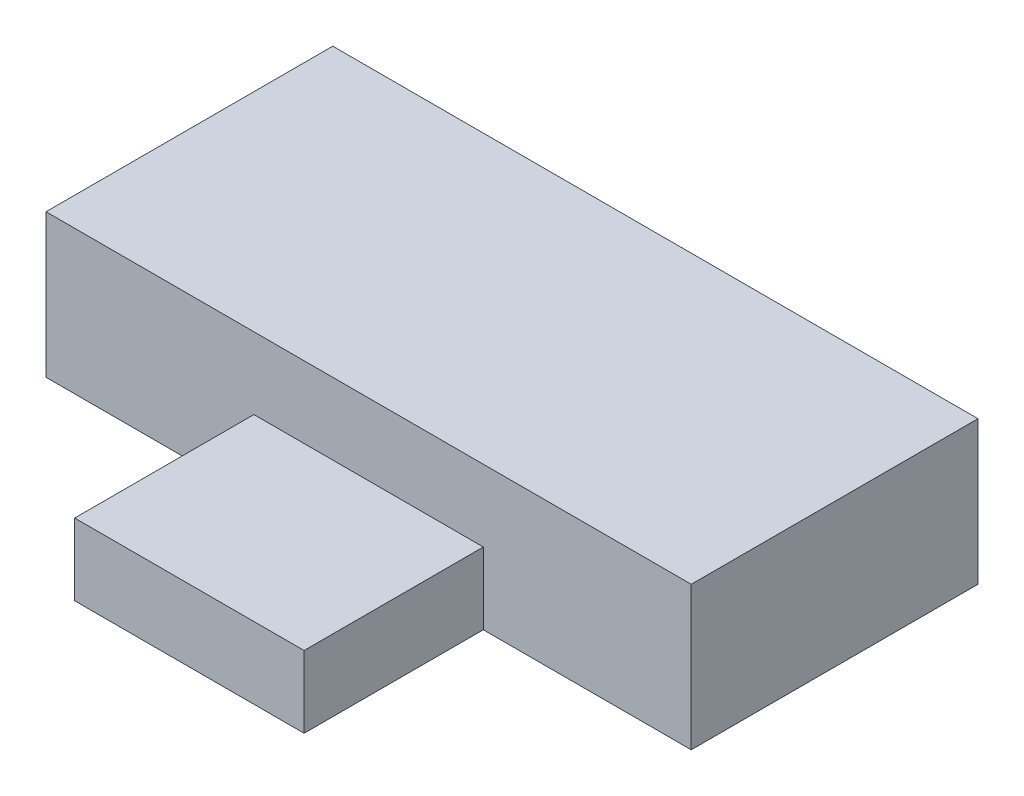
ISO-10303-21;
HEADER;
FILE_DESCRIPTION(('STEP AP214'),'2;1');
FILE_NAME('part.step','',(''),(''),'','','');
FILE_SCHEMA(('AUTOMOTIVE_DESIGN { 1 0 10303 214 1 1 1 1 }'));
ENDSEC;
DATA;
#1=APPLICATION_CONTEXT('core data for automotive mechanical design processes');
#2=APPLICATION_PROTOCOL_DEFINITION('international standard','automotive_design',2000,#1);
#3=PRODUCT_CONTEXT('',#1,'mechanical');
#4=PRODUCT('Part','Part','',(#3));
#5=PRODUCT_RELATED_PRODUCT_CATEGORY('part','',(#4));
#6=PRODUCT_DEFINITION_FORMATION('','',#4);
#7=PRODUCT_DEFINITION_CONTEXT('part definition',#1,'design');
#8=PRODUCT_DEFINITION('design','',#6,#7);
#9=PRODUCT_DEFINITION_SHAPE('','',#8);
#10=(LENGTH_UNIT() NAMED_UNIT(*) SI_UNIT(.MILLI.,.METRE.));
#11=(NAMED_UNIT(*) PLANE_ANGLE_UNIT() SI_UNIT($,.RADIAN.));
#12=(NAMED_UNIT(*) SI_UNIT($,.STERADIAN.) SOLID_ANGLE_UNIT());
#13=UNCERTAINTY_MEASURE_WITH_UNIT(LENGTH_MEASURE(1.E-05),#10,'distance_accuracy_value','');
#14=(GEOMETRIC_REPRESENTATION_CONTEXT(3) GLOBAL_UNCERTAINTY_ASSIGNED_CONTEXT((#13)) GLOBAL_UNIT_ASSIGNED_CONTEXT((#10,
#11,#12)) REPRESENTATION_CONTEXT('',''));
#15=CARTESIAN_POINT('',(0.,0.,0.));
#16=DIRECTION('',(0.,0.,1.));
#17=DIRECTION('',(1.,0.,0.));
#18=AXIS2_PLACEMENT_3D('',#15,#16,#17);
#19=CARTESIAN_POINT('',(-9.,4.,4.));
#20=DIRECTION('',(0.,0.,-1.));
#21=DIRECTION('',(-1.,0.,0.));
#22=AXIS2_PLACEMENT_3D('',#19,#20,#21);
#23=PLANE('',#22);
#24=DIRECTION('',(0.,1.,0.));
#25=VECTOR('',#24,1.);
#26=CARTESIAN_POINT('',(3.2,2.,4.));
#27=LINE('',#26,#25);
#28=CARTESIAN_POINT('',(3.2,0.,4.));
#29=VERTEX_POINT('',#28);
#30=CARTESIAN_POINT('',(3.2,2.,4.));
#31=VERTEX_POINT('',#30);
#32=EDGE_CURVE('E55',#29,#31,#27,.T.);
#33=ORIENTED_EDGE('',*,*,#32,.F.);
#34=DIRECTION('',(1.,0.,0.));
#35=VECTOR('',#34,1.);
#36=CARTESIAN_POINT('',(-9.,0.,4.));
#37=LINE('',#36,#35);
#38=CARTESIAN_POINT('',(9.,0.,4.));
#39=VERTEX_POINT('',#38);
#40=EDGE_CURVE('E143',#29,#39,#37,.T.);
#41=ORIENTED_EDGE('',*,*,#40,.T.);
#42=DIRECTION('',(0.,-1.,0.));
#43=VECTOR('',#42,1.);
#44=CARTESIAN_POINT('',(9.,4.,4.));
#45=LINE('',#44,#43);
#46=CARTESIAN_POINT('',(9.,4.,4.));
#47=VERTEX_POINT('',#46);
#48=EDGE_CURVE('E138',#47,#39,#45,.T.);
#49=ORIENTED_EDGE('',*,*,#48,.F.);
#50=DIRECTION('',(1.,0.,0.));
#51=VECTOR('',#50,1.);
#52=CARTESIAN_POINT('',(-9.,4.,4.));
#53=LINE('',#52,#51);
#54=CARTESIAN_POINT('',(-9.,4.,4.));
#55=VERTEX_POINT('',#54);
#56=EDGE_CURVE('E137',#55,#47,#53,.T.);
#57=ORIENTED_EDGE('',*,*,#56,.F.);
#58=DIRECTION('',(0.,-1.,0.));
#59=VECTOR('',#58,1.);
#60=CARTESIAN_POINT('',(-9.,4.,4.));
#61=LINE('',#60,#59);
#62=CARTESIAN_POINT('',(-9.,0.,4.));
#63=VERTEX_POINT('',#62);
#64=EDGE_CURVE('E153',#55,#63,#61,.T.);
#65=ORIENTED_EDGE('',*,*,#64,.T.);
#66=CARTESIAN_POINT('',(-3.2,0.,4.));
#67=VERTEX_POINT('',#66);
#68=EDGE_CURVE('E133',#63,#67,#37,.T.);
#69=ORIENTED_EDGE('',*,*,#68,.T.);
#70=DIRECTION('',(0.,-1.,0.));
#71=VECTOR('',#70,1.);
#72=CARTESIAN_POINT('',(-3.2,2.,4.));
#73=LINE('',#72,#71);
#74=CARTESIAN_POINT('',(-3.2,2.,4.));
#75=VERTEX_POINT('',#74);
#76=EDGE_CURVE('E117',#75,#67,#73,.T.);
#77=ORIENTED_EDGE('',*,*,#76,.F.);
#78=DIRECTION('',(-1.,0.,0.));
#79=VECTOR('',#78,1.);
#80=CARTESIAN_POINT('',(-3.2,2.,4.));
#81=LINE('',#80,#79);
#82=EDGE_CURVE('E50',#31,#75,#81,.T.);
#83=ORIENTED_EDGE('',*,*,#82,.F.);
#84=EDGE_LOOP('',(#33,#41,#49,#57,#65,#69,#77,#83));
#85=FACE_BOUND('',#84,.T.);
#86=ADVANCED_FACE('F33',(#85),#23,.F.);
#87=CARTESIAN_POINT('',(9.,4.,-4.));
#88=DIRECTION('',(-1.,0.,0.));
#89=DIRECTION('',(0.,0.,1.));
#90=AXIS2_PLACEMENT_3D('',#87,#88,#89);
#91=PLANE('',#90);
#92=DIRECTION('',(0.,0.,-1.));
#93=VECTOR('',#92,1.);
#94=CARTESIAN_POINT('',(9.,0.,-4.));
#95=LINE('',#94,#93);
#96=CARTESIAN_POINT('',(9.,0.,-4.));
#97=VERTEX_POINT('',#96);
#98=EDGE_CURVE('E120',#39,#97,#95,.T.);
#99=ORIENTED_EDGE('',*,*,#98,.T.);
#100=DIRECTION('',(0.,-1.,0.));
#101=VECTOR('',#100,1.);
#102=CARTESIAN_POINT('',(9.,4.,-4.));
#103=LINE('',#102,#101);
#104=CARTESIAN_POINT('',(9.,4.,-4.));
#105=VERTEX_POINT('',#104);
#106=EDGE_CURVE('E11',#105,#97,#103,.T.);
#107=ORIENTED_EDGE('',*,*,#106,.F.);
#108=DIRECTION('',(0.,0.,-1.));
#109=VECTOR('',#108,1.);
#110=CARTESIAN_POINT('',(9.,4.,-4.));
#111=LINE('',#110,#109);
#112=EDGE_CURVE('E129',#47,#105,#111,.T.);
#113=ORIENTED_EDGE('',*,*,#112,.F.);
#114=ORIENTED_EDGE('',*,*,#48,.T.);
#115=EDGE_LOOP('',(#99,#107,#113,#114));
#116=FACE_BOUND('',#115,.T.);
#117=ADVANCED_FACE('F35',(#116),#91,.F.);
#118=CARTESIAN_POINT('',(-9.,4.,-4.));
#119=DIRECTION('',(0.,0.,1.));
#120=DIRECTION('',(1.,0.,0.));
#121=AXIS2_PLACEMENT_3D('',#118,#119,#120);
#122=PLANE('',#121);
#123=DIRECTION('',(-1.,0.,0.));
#124=VECTOR('',#123,1.);
#125=CARTESIAN_POINT('',(-9.,0.,-4.));
#126=LINE('',#125,#124);
#127=CARTESIAN_POINT('',(-9.,0.,-4.));
#128=VERTEX_POINT('',#127);
#129=EDGE_CURVE('E123',#97,#128,#126,.T.);
#130=ORIENTED_EDGE('',*,*,#129,.T.);
#131=DIRECTION('',(0.,-1.,0.));
#132=VECTOR('',#131,1.);
#133=CARTESIAN_POINT('',(-9.,4.,-4.));
#134=LINE('',#133,#132);
#135=CARTESIAN_POINT('',(-9.,4.,-4.));
#136=VERTEX_POINT('',#135);
#137=EDGE_CURVE('E42',#136,#128,#134,.T.);
#138=ORIENTED_EDGE('',*,*,#137,.F.);
#139=DIRECTION('',(-1.,0.,0.));
#140=VECTOR('',#139,1.);
#141=CARTESIAN_POINT('',(-9.,4.,-4.));
#142=LINE('',#141,#140);
#143=EDGE_CURVE('E132',#105,#136,#142,.T.);
#144=ORIENTED_EDGE('',*,*,#143,.F.);
#145=ORIENTED_EDGE('',*,*,#106,.T.);
#146=EDGE_LOOP('',(#130,#138,#144,#145));
#147=FACE_BOUND('',#146,.T.);
#148=ADVANCED_FACE('F169',(#147),#122,.F.);
#149=CARTESIAN_POINT('',(-9.,4.,-4.));
#150=DIRECTION('',(1.,0.,0.));
#151=DIRECTION('',(0.,0.,-1.));
#152=AXIS2_PLACEMENT_3D('',#149,#150,#151);
#153=PLANE('',#152);
#154=DIRECTION('',(0.,0.,1.));
#155=VECTOR('',#154,1.);
#156=CARTESIAN_POINT('',(-9.,0.,-4.));
#157=LINE('',#156,#155);
#158=EDGE_CURVE('E141',#128,#63,#157,.T.);
#159=ORIENTED_EDGE('',*,*,#158,.T.);
#160=ORIENTED_EDGE('',*,*,#64,.F.);
#161=DIRECTION('',(0.,0.,1.));
#162=VECTOR('',#161,1.);
#163=CARTESIAN_POINT('',(-9.,4.,-4.));
#164=LINE('',#163,#162);
#165=EDGE_CURVE('E135',#136,#55,#164,.T.);
#166=ORIENTED_EDGE('',*,*,#165,.F.);
#167=ORIENTED_EDGE('',*,*,#137,.T.);
#168=EDGE_LOOP('',(#159,#160,#166,#167));
#169=FACE_BOUND('',#168,.T.);
#170=ADVANCED_FACE('F181',(#169),#153,.F.);
#171=CARTESIAN_POINT('',(0.,4.,0.));
#172=DIRECTION('',(0.,1.,0.));
#173=DIRECTION('',(0.,0.,1.));
#174=AXIS2_PLACEMENT_3D('',#171,#172,#173);
#175=PLANE('',#174);
#176=ORIENTED_EDGE('',*,*,#112,.T.);
#177=ORIENTED_EDGE('',*,*,#143,.T.);
#178=ORIENTED_EDGE('',*,*,#165,.T.);
#179=ORIENTED_EDGE('',*,*,#56,.T.);
#180=EDGE_LOOP('',(#176,#177,#178,#179));
#181=FACE_BOUND('',#180,.T.);
#182=ADVANCED_FACE('F172',(#181),#175,.T.);
#183=CARTESIAN_POINT('',(0.,0.,0.));
#184=DIRECTION('',(0.,1.,0.));
#185=DIRECTION('',(0.,0.,1.));
#186=AXIS2_PLACEMENT_3D('',#183,#184,#185);
#187=PLANE('',#186);
#188=ORIENTED_EDGE('',*,*,#98,.F.);
#189=ORIENTED_EDGE('',*,*,#40,.F.);
#190=DIRECTION('',(0.,0.,-1.));
#191=VECTOR('',#190,1.);
#192=CARTESIAN_POINT('',(3.2,0.,9.));
#193=LINE('',#192,#191);
#194=CARTESIAN_POINT('',(3.2,0.,9.));
#195=VERTEX_POINT('',#194);
#196=EDGE_CURVE('E262',#195,#29,#193,.T.);
#197=ORIENTED_EDGE('',*,*,#196,.F.);
#198=DIRECTION('',(1.,0.,0.));
#199=VECTOR('',#198,1.);
#200=CARTESIAN_POINT('',(-3.2,0.,9.));
#201=LINE('',#200,#199);
#202=CARTESIAN_POINT('',(-3.2,0.,9.));
#203=VERTEX_POINT('',#202);
#204=EDGE_CURVE('E113',#203,#195,#201,.T.);
#205=ORIENTED_EDGE('',*,*,#204,.F.);
#206=DIRECTION('',(0.,0.,-1.));
#207=VECTOR('',#206,1.);
#208=CARTESIAN_POINT('',(-3.2,0.,9.));
#209=LINE('',#208,#207);
#210=EDGE_CURVE('E125',#203,#67,#209,.T.);
#211=ORIENTED_EDGE('',*,*,#210,.T.);
#212=ORIENTED_EDGE('',*,*,#68,.F.);
#213=ORIENTED_EDGE('',*,*,#158,.F.);
#214=ORIENTED_EDGE('',*,*,#129,.F.);
#215=EDGE_LOOP('',(#188,#189,#197,#205,#211,#212,#213,#214));
#216=FACE_BOUND('',#215,.T.);
#217=ADVANCED_FACE('F165',(#216),#187,.F.);
#218=CARTESIAN_POINT('',(3.2,2.,9.));
#219=DIRECTION('',(-1.,0.,0.));
#220=DIRECTION('',(0.,-1.,0.));
#221=AXIS2_PLACEMENT_3D('',#218,#219,#220);
#222=PLANE('',#221);
#223=ORIENTED_EDGE('',*,*,#32,.T.);
#224=DIRECTION('',(0.,0.,-1.));
#225=VECTOR('',#224,1.);
#226=CARTESIAN_POINT('',(3.2,2.,9.));
#227=LINE('',#226,#225);
#228=CARTESIAN_POINT('',(3.2,2.,9.));
#229=VERTEX_POINT('',#228);
#230=EDGE_CURVE('E102',#229,#31,#227,.T.);
#231=ORIENTED_EDGE('',*,*,#230,.F.);
#232=DIRECTION('',(0.,1.,0.));
#233=VECTOR('',#232,1.);
#234=CARTESIAN_POINT('',(3.2,2.,9.));
#235=LINE('',#234,#233);
#236=EDGE_CURVE('E108',#195,#229,#235,.T.);
#237=ORIENTED_EDGE('',*,*,#236,.F.);
#238=ORIENTED_EDGE('',*,*,#196,.T.);
#239=EDGE_LOOP('',(#223,#231,#237,#238));
#240=FACE_BOUND('',#239,.T.);
#241=ADVANCED_FACE('F119',(#240),#222,.F.);
#242=CARTESIAN_POINT('',(-3.2,2.,9.));
#243=DIRECTION('',(0.,-1.,0.));
#244=DIRECTION('',(0.,0.,-1.));
#245=AXIS2_PLACEMENT_3D('',#242,#243,#244);
#246=PLANE('',#245);
#247=ORIENTED_EDGE('',*,*,#82,.T.);
#248=DIRECTION('',(0.,0.,-1.));
#249=VECTOR('',#248,1.);
#250=CARTESIAN_POINT('',(-3.2,2.,9.));
#251=LINE('',#250,#249);
#252=CARTESIAN_POINT('',(-3.2,2.,9.));
#253=VERTEX_POINT('',#252);
#254=EDGE_CURVE('E104',#253,#75,#251,.T.);
#255=ORIENTED_EDGE('',*,*,#254,.F.);
#256=DIRECTION('',(-1.,0.,0.));
#257=VECTOR('',#256,1.);
#258=CARTESIAN_POINT('',(-3.2,2.,9.));
#259=LINE('',#258,#257);
#260=EDGE_CURVE('E98',#229,#253,#259,.T.);
#261=ORIENTED_EDGE('',*,*,#260,.F.);
#262=ORIENTED_EDGE('',*,*,#230,.T.);
#263=EDGE_LOOP('',(#247,#255,#261,#262));
#264=FACE_BOUND('',#263,.T.);
#265=ADVANCED_FACE('F100',(#264),#246,.F.);
#266=CARTESIAN_POINT('',(-3.2,2.,9.));
#267=DIRECTION('',(1.,0.,0.));
#268=DIRECTION('',(0.,1.,0.));
#269=AXIS2_PLACEMENT_3D('',#266,#267,#268);
#270=PLANE('',#269);
#271=ORIENTED_EDGE('',*,*,#76,.T.);
#272=ORIENTED_EDGE('',*,*,#210,.F.);
#273=DIRECTION('',(0.,-1.,0.));
#274=VECTOR('',#273,1.);
#275=CARTESIAN_POINT('',(-3.2,2.,9.));
#276=LINE('',#275,#274);
#277=EDGE_CURVE('E107',#253,#203,#276,.T.);
#278=ORIENTED_EDGE('',*,*,#277,.F.);
#279=ORIENTED_EDGE('',*,*,#254,.T.);
#280=EDGE_LOOP('',(#271,#272,#278,#279));
#281=FACE_BOUND('',#280,.T.);
#282=ADVANCED_FACE('F215',(#281),#270,.F.);
#283=CARTESIAN_POINT('',(0.,0.,9.));
#284=DIRECTION('',(0.,0.,1.));
#285=DIRECTION('',(1.,0.,0.));
#286=AXIS2_PLACEMENT_3D('',#283,#284,#285);
#287=PLANE('',#286);
#288=ORIENTED_EDGE('',*,*,#236,.T.);
#289=ORIENTED_EDGE('',*,*,#260,.T.);
#290=ORIENTED_EDGE('',*,*,#277,.T.);
#291=ORIENTED_EDGE('',*,*,#204,.T.);
#292=EDGE_LOOP('',(#288,#289,#290,#291));
#293=FACE_BOUND('',#292,.T.);
#294=ADVANCED_FACE('F111',(#293),#287,.T.);
#295=CLOSED_SHELL('',(#86,#117,#148,#170,#182,#217,#241,#265,#282,#294));
#296=MANIFOLD_SOLID_BREP('B2',#295);
#297=ADVANCED_BREP_SHAPE_REPRESENTATION('',(#18,#296),#14);
#298=SHAPE_DEFINITION_REPRESENTATION(#9,#297);
ENDSEC;
END-ISO-10303-21;
